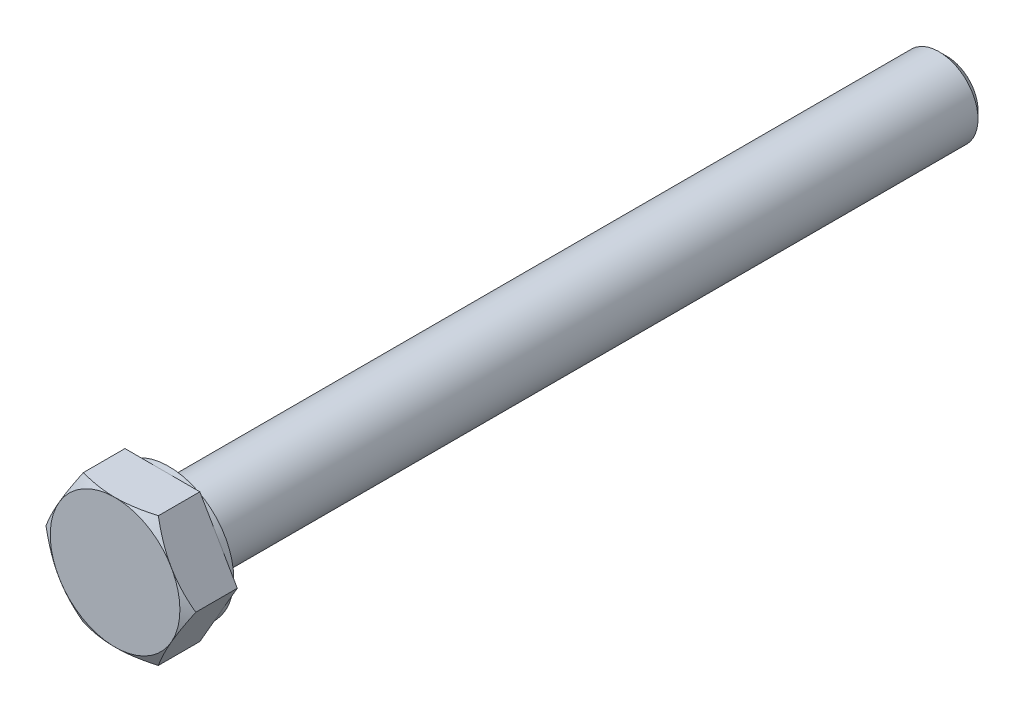
ISO-10303-21;
HEADER;
FILE_DESCRIPTION(('STEP AP214'),'2;1');
FILE_NAME('part.step','',(''),(''),'','','');
FILE_SCHEMA(('AUTOMOTIVE_DESIGN { 1 0 10303 214 1 1 1 1 }'));
ENDSEC;
DATA;
#1=APPLICATION_CONTEXT('core data for automotive mechanical design processes');
#2=APPLICATION_PROTOCOL_DEFINITION('international standard','automotive_design',2000,#1);
#3=PRODUCT_CONTEXT('',#1,'mechanical');
#4=PRODUCT('Part','Part','',(#3));
#5=PRODUCT_RELATED_PRODUCT_CATEGORY('part','',(#4));
#6=PRODUCT_DEFINITION_FORMATION('','',#4);
#7=PRODUCT_DEFINITION_CONTEXT('part definition',#1,'design');
#8=PRODUCT_DEFINITION('design','',#6,#7);
#9=PRODUCT_DEFINITION_SHAPE('','',#8);
#10=(LENGTH_UNIT() NAMED_UNIT(*) SI_UNIT(.MILLI.,.METRE.));
#11=(NAMED_UNIT(*) PLANE_ANGLE_UNIT() SI_UNIT($,.RADIAN.));
#12=(NAMED_UNIT(*) SI_UNIT($,.STERADIAN.) SOLID_ANGLE_UNIT());
#13=UNCERTAINTY_MEASURE_WITH_UNIT(LENGTH_MEASURE(1.E-05),#10,'distance_accuracy_value','');
#14=(GEOMETRIC_REPRESENTATION_CONTEXT(3) GLOBAL_UNCERTAINTY_ASSIGNED_CONTEXT((#13)) GLOBAL_UNIT_ASSIGNED_CONTEXT((#10,
#11,#12)) REPRESENTATION_CONTEXT('',''));
#15=CARTESIAN_POINT('',(0.,0.,0.));
#16=DIRECTION('',(0.,0.,1.));
#17=DIRECTION('',(1.,0.,0.));
#18=AXIS2_PLACEMENT_3D('',#15,#16,#17);
#19=CARTESIAN_POINT('',(0.,0.,4.15));
#20=DIRECTION('',(0.,0.,1.));
#21=DIRECTION('',(1.,0.,0.));
#22=AXIS2_PLACEMENT_3D('',#19,#20,#21);
#23=PLANE('',#22);
#24=CARTESIAN_POINT('',(0.,0.,4.15));
#25=DIRECTION('',(0.,0.,1.));
#26=DIRECTION('',(1.,0.,0.));
#27=AXIS2_PLACEMENT_3D('',#24,#25,#26);
#28=CIRCLE('',#27,5.);
#29=CARTESIAN_POINT('',(5.,0.,4.15));
#30=VERTEX_POINT('',#29);
#31=EDGE_CURVE('E10',#30,#30,#28,.T.);
#32=ORIENTED_EDGE('',*,*,#31,.T.);
#33=EDGE_LOOP('',(#32));
#34=FACE_BOUND('',#33,.T.);
#35=ADVANCED_FACE('F16',(#34),#23,.T.);
#36=CARTESIAN_POINT('',(0.,0.,4.15));
#37=DIRECTION('',(0.,0.,-1.));
#38=DIRECTION('',(1.,0.,0.));
#39=AXIS2_PLACEMENT_3D('',#36,#37,#38);
#40=CONICAL_SURFACE('',#39,5.,1.047197551197);
#41=CARTESIAN_POINT('',(2.8874999999992,5.00129670685568,3.70255354137743));
#42=CARTESIAN_POINT('',(4.33124999999986,2.50064835342825,4.53610299252072));
#43=CARTESIAN_POINT('',(5.77500000000043,9.62341317745086E-13,3.70255354137764));
#44=(BOUNDED_CURVE() B_SPLINE_CURVE(2,(#41,#42,#43),.UNSPECIFIED.,.F.,
.F.) B_SPLINE_CURVE_WITH_KNOTS((3,3),(0.,1.),
.UNSPECIFIED.) CURVE() GEOMETRIC_REPRESENTATION_ITEM() RATIONAL_B_SPLINE_CURVE((1.,
1.15470053837938,1.)) REPRESENTATION_ITEM(''));
#45=CARTESIAN_POINT('',(2.8875,5.001296706855,3.702553541378));
#46=VERTEX_POINT('',#45);
#47=CARTESIAN_POINT('',(5.775,0.,3.702553541378));
#48=VERTEX_POINT('',#47);
#49=EDGE_CURVE('E146',#46,#48,#44,.T.);
#50=ORIENTED_EDGE('',*,*,#49,.F.);
#51=CARTESIAN_POINT('',(-2.88750000000039,5.001296706855,3.70255354137778));
#52=CARTESIAN_POINT('',(-1.94066984704477E-13,5.00129670685504,4.53610299252048));
#53=CARTESIAN_POINT('',(2.88749999999987,5.001296706855,3.70255354137793));
#54=(BOUNDED_CURVE() B_SPLINE_CURVE(2,(#51,#52,#53),.UNSPECIFIED.,.F.,
.F.) B_SPLINE_CURVE_WITH_KNOTS((3,3),(0.,1.),
.UNSPECIFIED.) CURVE() GEOMETRIC_REPRESENTATION_ITEM() RATIONAL_B_SPLINE_CURVE((1.,
1.15470053837927,1.)) REPRESENTATION_ITEM(''));
#55=CARTESIAN_POINT('',(-2.8875,5.001296706855,3.702553541378));
#56=VERTEX_POINT('',#55);
#57=EDGE_CURVE('E193',#56,#46,#54,.T.);
#58=ORIENTED_EDGE('',*,*,#57,.F.);
#59=CARTESIAN_POINT('',(-5.7750000000016,-1.0627054791712E-12,3.70255354137697));
#60=CARTESIAN_POINT('',(-4.33125000000055,2.50064835342705,4.53610299252083));
#61=CARTESIAN_POINT('',(-2.88749999999986,5.00129670685454,3.70255354137781));
#62=(BOUNDED_CURVE() B_SPLINE_CURVE(2,(#59,#60,#61),.UNSPECIFIED.,.F.,
.F.) B_SPLINE_CURVE_WITH_KNOTS((3,3),(0.,1.),
.UNSPECIFIED.) CURVE() GEOMETRIC_REPRESENTATION_ITEM() RATIONAL_B_SPLINE_CURVE((1.,
1.15470053837943,1.)) REPRESENTATION_ITEM(''));
#63=CARTESIAN_POINT('',(-5.775,0.,3.702553541378));
#64=VERTEX_POINT('',#63);
#65=EDGE_CURVE('E205',#64,#56,#62,.T.);
#66=ORIENTED_EDGE('',*,*,#65,.F.);
#67=CARTESIAN_POINT('',(-2.8874999999992,-5.00129670685568,3.70255354137743));
#68=CARTESIAN_POINT('',(-4.33124999999987,-2.50064835342823,4.53610299252073));
#69=CARTESIAN_POINT('',(-5.77500000000045,-9.2104102122903E-13,3.70255354137763));
#70=(BOUNDED_CURVE() B_SPLINE_CURVE(2,(#67,#68,#69),.UNSPECIFIED.,.F.,
.F.) B_SPLINE_CURVE_WITH_KNOTS((3,3),(0.,1.),
.UNSPECIFIED.) CURVE() GEOMETRIC_REPRESENTATION_ITEM() RATIONAL_B_SPLINE_CURVE((1.,
1.15470053837938,1.)) REPRESENTATION_ITEM(''));
#71=CARTESIAN_POINT('',(-2.8875,-5.001296706855,3.702553541378));
#72=VERTEX_POINT('',#71);
#73=EDGE_CURVE('E132',#72,#64,#70,.T.);
#74=ORIENTED_EDGE('',*,*,#73,.F.);
#75=CARTESIAN_POINT('',(2.88750000000039,-5.001296706855,3.70255354137778));
#76=CARTESIAN_POINT('',(1.93622895494628E-13,-5.00129670685504,4.53610299252048));
#77=CARTESIAN_POINT('',(-2.88749999999987,-5.001296706855,3.70255354137793));
#78=(BOUNDED_CURVE() B_SPLINE_CURVE(2,(#75,#76,#77),.UNSPECIFIED.,.F.,
.F.) B_SPLINE_CURVE_WITH_KNOTS((3,3),(0.,1.),
.UNSPECIFIED.) CURVE() GEOMETRIC_REPRESENTATION_ITEM() RATIONAL_B_SPLINE_CURVE((1.,
1.15470053837927,1.)) REPRESENTATION_ITEM(''));
#79=CARTESIAN_POINT('',(2.8875,-5.001296706855,3.702553541378));
#80=VERTEX_POINT('',#79);
#81=EDGE_CURVE('E219',#80,#72,#78,.T.);
#82=ORIENTED_EDGE('',*,*,#81,.F.);
#83=CARTESIAN_POINT('',(5.77500000000167,1.18571819029967E-12,3.70255354137693));
#84=CARTESIAN_POINT('',(4.33125000000057,-2.50064835342701,4.53610299252084));
#85=CARTESIAN_POINT('',(2.88749999999986,-5.00129670685454,3.70255354137781));
#86=(BOUNDED_CURVE() B_SPLINE_CURVE(2,(#83,#84,#85),.UNSPECIFIED.,.F.,
.F.) B_SPLINE_CURVE_WITH_KNOTS((3,3),(0.,1.),
.UNSPECIFIED.) CURVE() GEOMETRIC_REPRESENTATION_ITEM() RATIONAL_B_SPLINE_CURVE((1.,
1.15470053837944,1.)) REPRESENTATION_ITEM(''));
#87=EDGE_CURVE('E42',#48,#80,#86,.T.);
#88=ORIENTED_EDGE('',*,*,#87,.F.);
#89=DIRECTION('',(0.866025403784329,0.,-0.50000000000019));
#90=VECTOR('',#89,1.);
#91=CARTESIAN_POINT('',(5.,0.,4.15));
#92=LINE('',#91,#90);
#93=EDGE_CURVE('E25',#30,#48,#92,.T.);
#94=ORIENTED_EDGE('',*,*,#93,.F.);
#95=ORIENTED_EDGE('',*,*,#31,.F.);
#96=ORIENTED_EDGE('',*,*,#93,.T.);
#97=EDGE_LOOP('',(#50,#58,#66,#74,#82,#88,#94,#95,#96));
#98=FACE_BOUND('',#97,.T.);
#99=ADVANCED_FACE('F238',(#98),#40,.T.);
#100=CARTESIAN_POINT('',(2.8875,-5.001296706855,0.));
#101=DIRECTION('',(-0.866025403784329,0.50000000000019,0.));
#102=DIRECTION('',(0.,0.,1.));
#103=AXIS2_PLACEMENT_3D('',#100,#101,#102);
#104=PLANE('',#103);
#105=DIRECTION('',(0.,0.,1.));
#106=VECTOR('',#105,1.);
#107=CARTESIAN_POINT('',(5.775,0.,0.5));
#108=LINE('',#107,#106);
#109=CARTESIAN_POINT('',(5.775,0.,0.5));
#110=VERTEX_POINT('',#109);
#111=EDGE_CURVE('E152',#110,#48,#108,.T.);
#112=ORIENTED_EDGE('',*,*,#111,.T.);
#113=ORIENTED_EDGE('',*,*,#87,.T.);
#114=DIRECTION('',(0.,0.,1.));
#115=VECTOR('',#114,1.);
#116=CARTESIAN_POINT('',(2.8875,-5.001296706855,0.));
#117=LINE('',#116,#115);
#118=CARTESIAN_POINT('',(2.8875,-5.001296706855,0.5));
#119=VERTEX_POINT('',#118);
#120=EDGE_CURVE('E137',#119,#80,#117,.T.);
#121=ORIENTED_EDGE('',*,*,#120,.F.);
#122=DIRECTION('',(0.50000000000019,0.866025403784329,0.));
#123=VECTOR('',#122,1.);
#124=CARTESIAN_POINT('',(3.609375,-3.750972530141,0.5));
#125=LINE('',#124,#123);
#126=EDGE_CURVE('E154',#119,#110,#125,.T.);
#127=ORIENTED_EDGE('',*,*,#126,.T.);
#128=EDGE_LOOP('',(#112,#113,#121,#127));
#129=FACE_BOUND('',#128,.T.);
#130=ADVANCED_FACE('F18',(#129),#104,.F.);
#131=CARTESIAN_POINT('',(-2.8875,-5.001296706855,0.));
#132=DIRECTION('',(0.,1.,0.));
#133=DIRECTION('',(1.,0.,0.));
#134=AXIS2_PLACEMENT_3D('',#131,#132,#133);
#135=PLANE('',#134);
#136=ORIENTED_EDGE('',*,*,#120,.T.);
#137=ORIENTED_EDGE('',*,*,#81,.T.);
#138=DIRECTION('',(0.,0.,1.));
#139=VECTOR('',#138,1.);
#140=CARTESIAN_POINT('',(-2.8875,-5.001296706855,0.));
#141=LINE('',#140,#139);
#142=CARTESIAN_POINT('',(-2.8875,-5.001296706855,0.5));
#143=VERTEX_POINT('',#142);
#144=EDGE_CURVE('E138',#143,#72,#141,.T.);
#145=ORIENTED_EDGE('',*,*,#144,.F.);
#146=DIRECTION('',(1.,0.,0.));
#147=VECTOR('',#146,1.);
#148=CARTESIAN_POINT('',(-1.44375,-5.001296706855,0.5));
#149=LINE('',#148,#147);
#150=EDGE_CURVE('E161',#143,#119,#149,.T.);
#151=ORIENTED_EDGE('',*,*,#150,.T.);
#152=EDGE_LOOP('',(#136,#137,#145,#151));
#153=FACE_BOUND('',#152,.T.);
#154=ADVANCED_FACE('F377',(#153),#135,.F.);
#155=CARTESIAN_POINT('',(-5.775,0.,0.));
#156=DIRECTION('',(0.866025403784329,0.50000000000019,0.));
#157=DIRECTION('',(0.,0.,-1.));
#158=AXIS2_PLACEMENT_3D('',#155,#156,#157);
#159=PLANE('',#158);
#160=ORIENTED_EDGE('',*,*,#144,.T.);
#161=ORIENTED_EDGE('',*,*,#73,.T.);
#162=DIRECTION('',(0.,0.,1.));
#163=VECTOR('',#162,1.);
#164=CARTESIAN_POINT('',(-5.775,0.,0.));
#165=LINE('',#164,#163);
#166=CARTESIAN_POINT('',(-5.775,0.,0.5));
#167=VERTEX_POINT('',#166);
#168=EDGE_CURVE('E198',#167,#64,#165,.T.);
#169=ORIENTED_EDGE('',*,*,#168,.F.);
#170=DIRECTION('',(0.50000000000019,-0.866025403784329,0.));
#171=VECTOR('',#170,1.);
#172=CARTESIAN_POINT('',(-5.053125,-1.250324176714,0.5));
#173=LINE('',#172,#171);
#174=EDGE_CURVE('E174',#167,#143,#173,.T.);
#175=ORIENTED_EDGE('',*,*,#174,.T.);
#176=EDGE_LOOP('',(#160,#161,#169,#175));
#177=FACE_BOUND('',#176,.T.);
#178=ADVANCED_FACE('F366',(#177),#159,.F.);
#179=CARTESIAN_POINT('',(-2.8875,5.001296706855,0.));
#180=DIRECTION('',(0.866025403784329,-0.50000000000019,0.));
#181=DIRECTION('',(0.,0.,-1.));
#182=AXIS2_PLACEMENT_3D('',#179,#180,#181);
#183=PLANE('',#182);
#184=ORIENTED_EDGE('',*,*,#168,.T.);
#185=ORIENTED_EDGE('',*,*,#65,.T.);
#186=DIRECTION('',(0.,0.,1.));
#187=VECTOR('',#186,1.);
#188=CARTESIAN_POINT('',(-2.8875,5.001296706855,0.));
#189=LINE('',#188,#187);
#190=CARTESIAN_POINT('',(-2.8875,5.001296706855,0.5));
#191=VERTEX_POINT('',#190);
#192=EDGE_CURVE('E189',#191,#56,#189,.T.);
#193=ORIENTED_EDGE('',*,*,#192,.F.);
#194=DIRECTION('',(-0.50000000000019,-0.866025403784329,0.));
#195=VECTOR('',#194,1.);
#196=CARTESIAN_POINT('',(-3.609375,3.750972530141,0.5));
#197=LINE('',#196,#195);
#198=EDGE_CURVE('E169',#191,#167,#197,.T.);
#199=ORIENTED_EDGE('',*,*,#198,.T.);
#200=EDGE_LOOP('',(#184,#185,#193,#199));
#201=FACE_BOUND('',#200,.T.);
#202=ADVANCED_FACE('F357',(#201),#183,.F.);
#203=CARTESIAN_POINT('',(2.8875,5.001296706855,0.));
#204=DIRECTION('',(0.,-1.,0.));
#205=DIRECTION('',(-1.,0.,0.));
#206=AXIS2_PLACEMENT_3D('',#203,#204,#205);
#207=PLANE('',#206);
#208=ORIENTED_EDGE('',*,*,#192,.T.);
#209=ORIENTED_EDGE('',*,*,#57,.T.);
#210=DIRECTION('',(0.,0.,1.));
#211=VECTOR('',#210,1.);
#212=CARTESIAN_POINT('',(2.8875,5.001296706855,0.));
#213=LINE('',#212,#211);
#214=CARTESIAN_POINT('',(2.8875,5.001296706855,0.5));
#215=VERTEX_POINT('',#214);
#216=EDGE_CURVE('E153',#215,#46,#213,.T.);
#217=ORIENTED_EDGE('',*,*,#216,.F.);
#218=DIRECTION('',(-1.,0.,0.));
#219=VECTOR('',#218,1.);
#220=CARTESIAN_POINT('',(1.44375,5.001296706855,0.5));
#221=LINE('',#220,#219);
#222=EDGE_CURVE('E173',#215,#191,#221,.T.);
#223=ORIENTED_EDGE('',*,*,#222,.T.);
#224=EDGE_LOOP('',(#208,#209,#217,#223));
#225=FACE_BOUND('',#224,.T.);
#226=ADVANCED_FACE('F248',(#225),#207,.F.);
#227=CARTESIAN_POINT('',(5.775,0.,0.));
#228=DIRECTION('',(-0.866025403784329,-0.50000000000019,0.));
#229=DIRECTION('',(-0.50000000000019,0.866025403784329,0.));
#230=AXIS2_PLACEMENT_3D('',#227,#228,#229);
#231=PLANE('',#230);
#232=ORIENTED_EDGE('',*,*,#216,.T.);
#233=ORIENTED_EDGE('',*,*,#49,.T.);
#234=ORIENTED_EDGE('',*,*,#111,.F.);
#235=DIRECTION('',(-0.50000000000019,0.866025403784329,0.));
#236=VECTOR('',#235,1.);
#237=CARTESIAN_POINT('',(5.053125,1.250324176714,0.5));
#238=LINE('',#237,#236);
#239=EDGE_CURVE('E162',#110,#215,#238,.T.);
#240=ORIENTED_EDGE('',*,*,#239,.T.);
#241=EDGE_LOOP('',(#232,#233,#234,#240));
#242=FACE_BOUND('',#241,.T.);
#243=ADVANCED_FACE('F244',(#242),#231,.F.);
#244=CARTESIAN_POINT('',(0.,0.,0.5));
#245=DIRECTION('',(0.,0.,1.));
#246=DIRECTION('',(1.,0.,0.));
#247=AXIS2_PLACEMENT_3D('',#244,#245,#246);
#248=PLANE('',#247);
#249=CARTESIAN_POINT('',(0.,0.,0.5));
#250=DIRECTION('',(0.,0.,1.));
#251=DIRECTION('',(1.,0.,0.));
#252=AXIS2_PLACEMENT_3D('',#249,#250,#251);
#253=CIRCLE('',#252,5.);
#254=CARTESIAN_POINT('',(5.,0.,0.5));
#255=VERTEX_POINT('',#254);
#256=EDGE_CURVE('E166',#255,#255,#253,.T.);
#257=ORIENTED_EDGE('',*,*,#256,.T.);
#258=EDGE_LOOP('',(#257));
#259=FACE_BOUND('',#258,.T.);
#260=ORIENTED_EDGE('',*,*,#239,.F.);
#261=ORIENTED_EDGE('',*,*,#126,.F.);
#262=ORIENTED_EDGE('',*,*,#150,.F.);
#263=ORIENTED_EDGE('',*,*,#174,.F.);
#264=ORIENTED_EDGE('',*,*,#198,.F.);
#265=ORIENTED_EDGE('',*,*,#222,.F.);
#266=EDGE_LOOP('',(#260,#261,#262,#263,#264,#265));
#267=FACE_BOUND('',#266,.T.);
#268=ADVANCED_FACE('F251',(#259,#267),#248,.F.);
#269=CARTESIAN_POINT('',(0.,0.,0.));
#270=DIRECTION('',(0.,0.,1.));
#271=DIRECTION('',(1.,0.,0.));
#272=AXIS2_PLACEMENT_3D('',#269,#270,#271);
#273=CYLINDRICAL_SURFACE('',#272,5.);
#274=CARTESIAN_POINT('',(0.,0.,0.));
#275=DIRECTION('',(0.,0.,1.));
#276=DIRECTION('',(1.,0.,0.));
#277=AXIS2_PLACEMENT_3D('',#274,#275,#276);
#278=CIRCLE('',#277,5.);
#279=CARTESIAN_POINT('',(5.,0.,0.));
#280=VERTEX_POINT('',#279);
#281=EDGE_CURVE('E131',#280,#280,#278,.T.);
#282=ORIENTED_EDGE('',*,*,#281,.T.);
#283=DIRECTION('',(0.,0.,1.));
#284=VECTOR('',#283,1.);
#285=CARTESIAN_POINT('',(5.,0.,0.));
#286=LINE('',#285,#284);
#287=EDGE_CURVE('E145',#280,#255,#286,.T.);
#288=ORIENTED_EDGE('',*,*,#287,.T.);
#289=ORIENTED_EDGE('',*,*,#256,.F.);
#290=ORIENTED_EDGE('',*,*,#287,.F.);
#291=EDGE_LOOP('',(#282,#288,#289,#290));
#292=FACE_BOUND('',#291,.T.);
#293=ADVANCED_FACE('F267',(#292),#273,.T.);
#294=CARTESIAN_POINT('',(0.,0.,0.));
#295=DIRECTION('',(0.,0.,1.));
#296=DIRECTION('',(1.,0.,0.));
#297=AXIS2_PLACEMENT_3D('',#294,#295,#296);
#298=PLANE('',#297);
#299=ORIENTED_EDGE('',*,*,#281,.F.);
#300=EDGE_LOOP('',(#299));
#301=FACE_BOUND('',#300,.T.);
#302=CARTESIAN_POINT('',(0.,0.,0.));
#303=DIRECTION('',(0.,0.,1.));
#304=DIRECTION('',(1.,0.,0.));
#305=AXIS2_PLACEMENT_3D('',#302,#303,#304);
#306=CIRCLE('',#305,3.);
#307=CARTESIAN_POINT('',(3.,0.,0.));
#308=VERTEX_POINT('',#307);
#309=EDGE_CURVE('E128',#308,#308,#306,.T.);
#310=ORIENTED_EDGE('',*,*,#309,.T.);
#311=EDGE_LOOP('',(#310));
#312=FACE_BOUND('',#311,.T.);
#313=ADVANCED_FACE('F265',(#301,#312),#298,.F.);
#314=CARTESIAN_POINT('',(0.,0.,-59.4));
#315=DIRECTION('',(0.,0.,1.));
#316=DIRECTION('',(1.,0.,0.));
#317=AXIS2_PLACEMENT_3D('',#314,#315,#316);
#318=CYLINDRICAL_SURFACE('',#317,3.);
#319=CARTESIAN_POINT('',(0.,0.,-59.4));
#320=DIRECTION('',(0.,0.,1.));
#321=DIRECTION('',(1.,0.,0.));
#322=AXIS2_PLACEMENT_3D('',#319,#320,#321);
#323=CIRCLE('',#322,3.);
#324=CARTESIAN_POINT('',(3.,0.,-59.4));
#325=VERTEX_POINT('',#324);
#326=EDGE_CURVE('E116',#325,#325,#323,.T.);
#327=ORIENTED_EDGE('',*,*,#326,.T.);
#328=DIRECTION('',(0.,0.,1.));
#329=VECTOR('',#328,1.);
#330=CARTESIAN_POINT('',(3.,0.,-59.4));
#331=LINE('',#330,#329);
#332=EDGE_CURVE('E122',#325,#308,#331,.T.);
#333=ORIENTED_EDGE('',*,*,#332,.T.);
#334=ORIENTED_EDGE('',*,*,#309,.F.);
#335=ORIENTED_EDGE('',*,*,#332,.F.);
#336=EDGE_LOOP('',(#327,#333,#334,#335));
#337=FACE_BOUND('',#336,.T.);
#338=ADVANCED_FACE('F263',(#337),#318,.T.);
#339=CARTESIAN_POINT('',(0.,0.,-60.));
#340=DIRECTION('',(0.,0.,1.));
#341=DIRECTION('',(1.,0.,0.));
#342=AXIS2_PLACEMENT_3D('',#339,#340,#341);
#343=CONICAL_SURFACE('',#342,2.4,0.785398163397);
#344=CARTESIAN_POINT('',(0.,0.,-60.));
#345=DIRECTION('',(0.,0.,1.));
#346=DIRECTION('',(1.,0.,0.));
#347=AXIS2_PLACEMENT_3D('',#344,#345,#346);
#348=CIRCLE('',#347,2.4);
#349=CARTESIAN_POINT('',(2.4,0.,-60.));
#350=VERTEX_POINT('',#349);
#351=EDGE_CURVE('E114',#350,#350,#348,.T.);
#352=ORIENTED_EDGE('',*,*,#351,.T.);
#353=DIRECTION('',(0.707106781186548,0.,0.707106781186548));
#354=VECTOR('',#353,1.);
#355=CARTESIAN_POINT('',(2.4,0.,-60.));
#356=LINE('',#355,#354);
#357=EDGE_CURVE('E111',#350,#325,#356,.T.);
#358=ORIENTED_EDGE('',*,*,#357,.T.);
#359=ORIENTED_EDGE('',*,*,#326,.F.);
#360=ORIENTED_EDGE('',*,*,#357,.F.);
#361=EDGE_LOOP('',(#352,#358,#359,#360));
#362=FACE_BOUND('',#361,.T.);
#363=ADVANCED_FACE('F112',(#362),#343,.T.);
#364=CARTESIAN_POINT('',(0.,0.,-60.));
#365=DIRECTION('',(0.,0.,1.));
#366=DIRECTION('',(1.,0.,0.));
#367=AXIS2_PLACEMENT_3D('',#364,#365,#366);
#368=PLANE('',#367);
#369=ORIENTED_EDGE('',*,*,#351,.F.);
#370=EDGE_LOOP('',(#369));
#371=FACE_BOUND('',#370,.T.);
#372=ADVANCED_FACE('F287',(#371),#368,.F.);
#373=CLOSED_SHELL('',(#35,#99,#130,#154,#178,#202,#226,#243,#268,#293,#313,#338,#363,#372));
#374=MANIFOLD_SOLID_BREP('B1',#373);
#375=ADVANCED_BREP_SHAPE_REPRESENTATION('',(#18,#374),#14);
#376=SHAPE_DEFINITION_REPRESENTATION(#9,#375);
ENDSEC;
END-ISO-10303-21;
